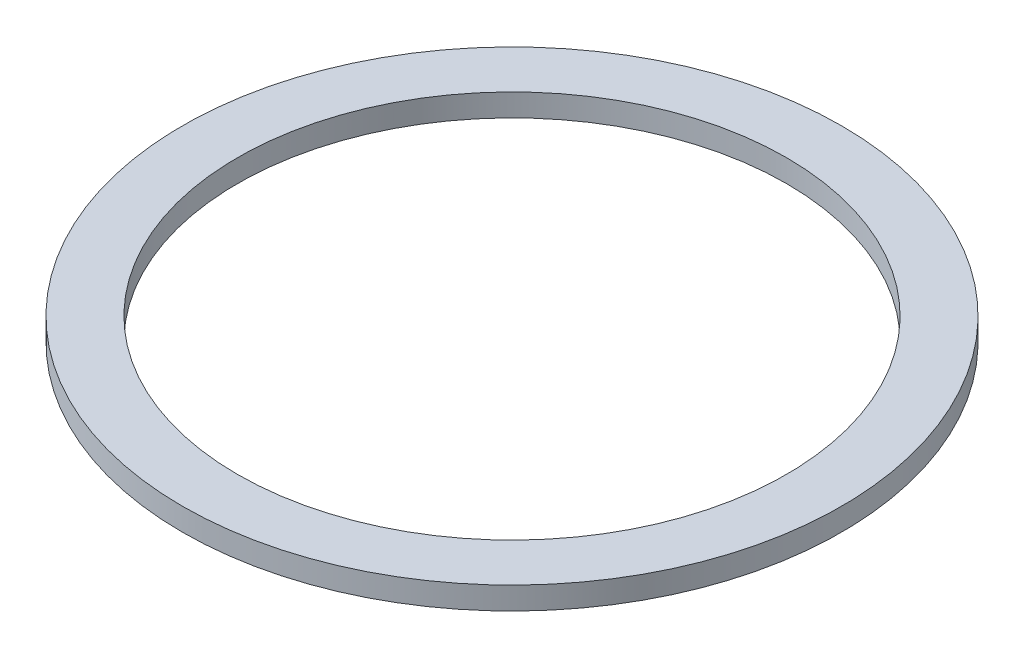
ISO-10303-21;
HEADER;
FILE_DESCRIPTION(('STEP AP214'),'2;1');
FILE_NAME('part.step','',(''),(''),'','','');
FILE_SCHEMA(('AUTOMOTIVE_DESIGN { 1 0 10303 214 1 1 1 1 }'));
ENDSEC;
DATA;
#1=APPLICATION_CONTEXT('core data for automotive mechanical design processes');
#2=APPLICATION_PROTOCOL_DEFINITION('international standard','automotive_design',2000,#1);
#3=PRODUCT_CONTEXT('',#1,'mechanical');
#4=PRODUCT('Part','Part','',(#3));
#5=PRODUCT_RELATED_PRODUCT_CATEGORY('part','',(#4));
#6=PRODUCT_DEFINITION_FORMATION('','',#4);
#7=PRODUCT_DEFINITION_CONTEXT('part definition',#1,'design');
#8=PRODUCT_DEFINITION('design','',#6,#7);
#9=PRODUCT_DEFINITION_SHAPE('','',#8);
#10=(LENGTH_UNIT() NAMED_UNIT(*) SI_UNIT(.MILLI.,.METRE.));
#11=(NAMED_UNIT(*) PLANE_ANGLE_UNIT() SI_UNIT($,.RADIAN.));
#12=(NAMED_UNIT(*) SI_UNIT($,.STERADIAN.) SOLID_ANGLE_UNIT());
#13=UNCERTAINTY_MEASURE_WITH_UNIT(LENGTH_MEASURE(1.E-05),#10,'distance_accuracy_value','');
#14=(GEOMETRIC_REPRESENTATION_CONTEXT(3) GLOBAL_UNCERTAINTY_ASSIGNED_CONTEXT((#13)) GLOBAL_UNIT_ASSIGNED_CONTEXT((#10,
#11,#12)) REPRESENTATION_CONTEXT('',''));
#15=CARTESIAN_POINT('',(0.,0.,0.));
#16=DIRECTION('',(0.,0.,1.));
#17=DIRECTION('',(1.,0.,0.));
#18=AXIS2_PLACEMENT_3D('',#15,#16,#17);
#19=CARTESIAN_POINT('',(0.,1.,0.));
#20=DIRECTION('',(0.,1.,0.));
#21=DIRECTION('',(0.,0.,1.));
#22=AXIS2_PLACEMENT_3D('',#19,#20,#21);
#23=PLANE('',#22);
#24=CARTESIAN_POINT('',(0.,1.,0.));
#25=DIRECTION('',(0.,1.,0.));
#26=DIRECTION('',(0.,0.,1.));
#27=AXIS2_PLACEMENT_3D('',#24,#25,#26);
#28=CIRCLE('',#27,14.65);
#29=CARTESIAN_POINT('',(0.,1.,14.65));
#30=VERTEX_POINT('',#29);
#31=EDGE_CURVE('E10',#30,#30,#28,.T.);
#32=ORIENTED_EDGE('',*,*,#31,.T.);
#33=EDGE_LOOP('',(#32));
#34=FACE_BOUND('',#33,.T.);
#35=CARTESIAN_POINT('',(0.,1.,0.));
#36=DIRECTION('',(0.,1.,0.));
#37=DIRECTION('',(0.,0.,1.));
#38=AXIS2_PLACEMENT_3D('',#35,#36,#37);
#39=CIRCLE('',#38,12.2);
#40=CARTESIAN_POINT('',(0.,1.,12.2));
#41=VERTEX_POINT('',#40);
#42=EDGE_CURVE('E44',#41,#41,#39,.T.);
#43=ORIENTED_EDGE('',*,*,#42,.F.);
#44=EDGE_LOOP('',(#43));
#45=FACE_BOUND('',#44,.T.);
#46=ADVANCED_FACE('F33',(#34,#45),#23,.T.);
#47=CARTESIAN_POINT('',(0.,0.,0.));
#48=DIRECTION('',(0.,1.,0.));
#49=DIRECTION('',(0.,0.,1.));
#50=AXIS2_PLACEMENT_3D('',#47,#48,#49);
#51=PLANE('',#50);
#52=CARTESIAN_POINT('',(0.,0.,0.));
#53=DIRECTION('',(0.,1.,0.));
#54=DIRECTION('',(0.,0.,1.));
#55=AXIS2_PLACEMENT_3D('',#52,#53,#54);
#56=CIRCLE('',#55,14.65);
#57=CARTESIAN_POINT('',(0.,0.,14.65));
#58=VERTEX_POINT('',#57);
#59=EDGE_CURVE('E37',#58,#58,#56,.T.);
#60=ORIENTED_EDGE('',*,*,#59,.F.);
#61=EDGE_LOOP('',(#60));
#62=FACE_BOUND('',#61,.T.);
#63=CARTESIAN_POINT('',(0.,0.,0.));
#64=DIRECTION('',(0.,1.,0.));
#65=DIRECTION('',(0.,0.,1.));
#66=AXIS2_PLACEMENT_3D('',#63,#64,#65);
#67=CIRCLE('',#66,12.2);
#68=CARTESIAN_POINT('',(0.,0.,12.2));
#69=VERTEX_POINT('',#68);
#70=EDGE_CURVE('E46',#69,#69,#67,.T.);
#71=ORIENTED_EDGE('',*,*,#70,.T.);
#72=EDGE_LOOP('',(#71));
#73=FACE_BOUND('',#72,.T.);
#74=ADVANCED_FACE('F56',(#62,#73),#51,.F.);
#75=CARTESIAN_POINT('',(0.,1.,0.));
#76=DIRECTION('',(0.,-1.,0.));
#77=DIRECTION('',(0.,0.,-1.));
#78=AXIS2_PLACEMENT_3D('',#75,#76,#77);
#79=CYLINDRICAL_SURFACE('',#78,14.65);
#80=ORIENTED_EDGE('',*,*,#31,.F.);
#81=EDGE_LOOP('',(#80));
#82=FACE_BOUND('',#81,.T.);
#83=ORIENTED_EDGE('',*,*,#59,.T.);
#84=EDGE_LOOP('',(#83));
#85=FACE_BOUND('',#84,.T.);
#86=ADVANCED_FACE('F35',(#82,#85),#79,.T.);
#87=CARTESIAN_POINT('',(0.,1.,0.));
#88=DIRECTION('',(0.,-1.,0.));
#89=DIRECTION('',(0.,0.,-1.));
#90=AXIS2_PLACEMENT_3D('',#87,#88,#89);
#91=CYLINDRICAL_SURFACE('',#90,12.2);
#92=ORIENTED_EDGE('',*,*,#42,.T.);
#93=EDGE_LOOP('',(#92));
#94=FACE_BOUND('',#93,.T.);
#95=ORIENTED_EDGE('',*,*,#70,.F.);
#96=EDGE_LOOP('',(#95));
#97=FACE_BOUND('',#96,.T.);
#98=ADVANCED_FACE('F52',(#94,#97),#91,.F.);
#99=CLOSED_SHELL('',(#46,#74,#86,#98));
#100=MANIFOLD_SOLID_BREP('B2',#99);
#101=ADVANCED_BREP_SHAPE_REPRESENTATION('',(#18,#100),#14);
#102=SHAPE_DEFINITION_REPRESENTATION(#9,#101);
ENDSEC;
END-ISO-10303-21;
